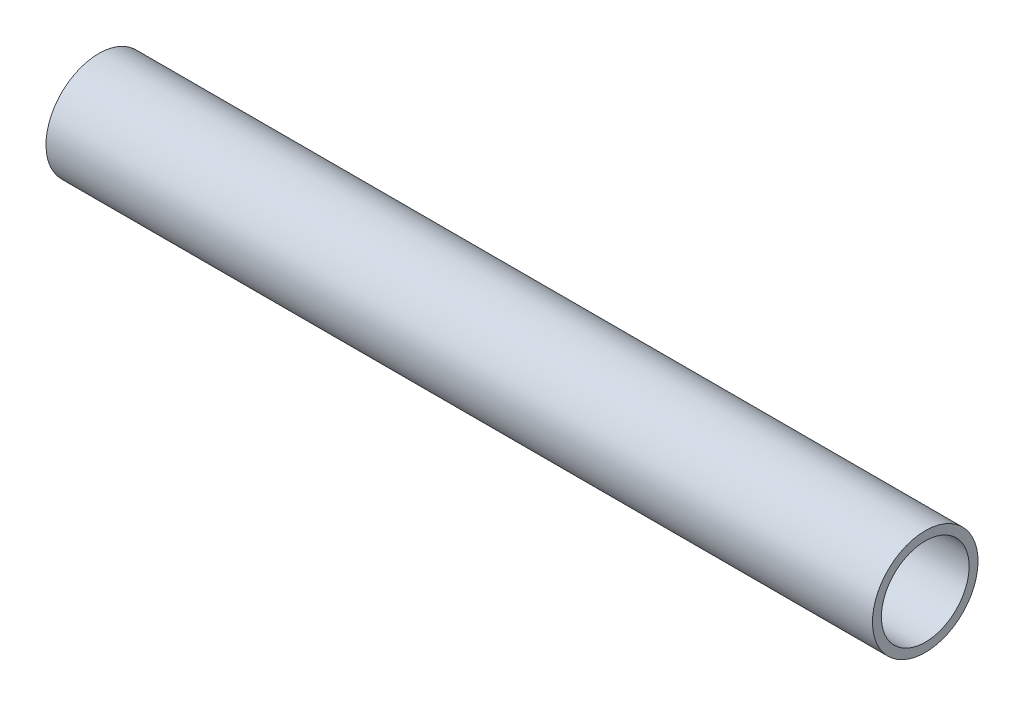
ISO-10303-21;
HEADER;
FILE_DESCRIPTION(('STEP AP214'),'2;1');
FILE_NAME('part.step','',(''),(''),'','','');
FILE_SCHEMA(('AUTOMOTIVE_DESIGN { 1 0 10303 214 1 1 1 1 }'));
ENDSEC;
DATA;
#1=APPLICATION_CONTEXT('core data for automotive mechanical design processes');
#2=APPLICATION_PROTOCOL_DEFINITION('international standard','automotive_design',2000,#1);
#3=PRODUCT_CONTEXT('',#1,'mechanical');
#4=PRODUCT('Part','Part','',(#3));
#5=PRODUCT_RELATED_PRODUCT_CATEGORY('part','',(#4));
#6=PRODUCT_DEFINITION_FORMATION('','',#4);
#7=PRODUCT_DEFINITION_CONTEXT('part definition',#1,'design');
#8=PRODUCT_DEFINITION('design','',#6,#7);
#9=PRODUCT_DEFINITION_SHAPE('','',#8);
#10=(LENGTH_UNIT() NAMED_UNIT(*) SI_UNIT(.MILLI.,.METRE.));
#11=(NAMED_UNIT(*) PLANE_ANGLE_UNIT() SI_UNIT($,.RADIAN.));
#12=(NAMED_UNIT(*) SI_UNIT($,.STERADIAN.) SOLID_ANGLE_UNIT());
#13=UNCERTAINTY_MEASURE_WITH_UNIT(LENGTH_MEASURE(1.E-05),#10,'distance_accuracy_value','');
#14=(GEOMETRIC_REPRESENTATION_CONTEXT(3) GLOBAL_UNCERTAINTY_ASSIGNED_CONTEXT((#13)) GLOBAL_UNIT_ASSIGNED_CONTEXT((#10,
#11,#12)) REPRESENTATION_CONTEXT('',''));
#15=CARTESIAN_POINT('',(0.,0.,0.));
#16=DIRECTION('',(0.,0.,1.));
#17=DIRECTION('',(1.,0.,0.));
#18=AXIS2_PLACEMENT_3D('',#15,#16,#17);
#19=CARTESIAN_POINT('',(165.1,-194.818,2112.518));
#20=DIRECTION('',(-1.,0.,0.));
#21=DIRECTION('',(0.,0.,1.));
#22=AXIS2_PLACEMENT_3D('',#19,#20,#21);
#23=CYLINDRICAL_SURFACE('',#22,17.526);
#24=CARTESIAN_POINT('',(165.1,-194.818,2112.518));
#25=DIRECTION('',(1.,0.,0.));
#26=DIRECTION('',(0.,1.,0.));
#27=AXIS2_PLACEMENT_3D('',#24,#25,#26);
#28=CIRCLE('',#27,17.526);
#29=CARTESIAN_POINT('',(165.1,-177.292,2112.518));
#30=VERTEX_POINT('',#29);
#31=EDGE_CURVE('E20',#30,#30,#28,.T.);
#32=ORIENTED_EDGE('',*,*,#31,.T.);
#33=EDGE_LOOP('',(#32));
#34=FACE_BOUND('',#33,.T.);
#35=CARTESIAN_POINT('',(-165.1,-194.818,2112.518));
#36=DIRECTION('',(1.,0.,0.));
#37=DIRECTION('',(0.,1.,0.));
#38=AXIS2_PLACEMENT_3D('',#35,#36,#37);
#39=CIRCLE('',#38,17.526);
#40=CARTESIAN_POINT('',(-165.1,-177.292,2112.518));
#41=VERTEX_POINT('',#40);
#42=EDGE_CURVE('E31',#41,#41,#39,.T.);
#43=ORIENTED_EDGE('',*,*,#42,.F.);
#44=EDGE_LOOP('',(#43));
#45=FACE_BOUND('',#44,.T.);
#46=ADVANCED_FACE('F12',(#34,#45),#23,.F.);
#47=CARTESIAN_POINT('',(165.1,-194.818,2112.518));
#48=DIRECTION('',(-1.,0.,0.));
#49=DIRECTION('',(0.,0.,1.));
#50=AXIS2_PLACEMENT_3D('',#47,#48,#49);
#51=CYLINDRICAL_SURFACE('',#50,21.082);
#52=CARTESIAN_POINT('',(165.1,-194.818,2112.518));
#53=DIRECTION('',(1.,0.,0.));
#54=DIRECTION('',(0.,1.,0.));
#55=AXIS2_PLACEMENT_3D('',#52,#53,#54);
#56=CIRCLE('',#55,21.082);
#57=CARTESIAN_POINT('',(165.1,-173.736,2112.518));
#58=VERTEX_POINT('',#57);
#59=EDGE_CURVE('E8',#58,#58,#56,.T.);
#60=ORIENTED_EDGE('',*,*,#59,.F.);
#61=EDGE_LOOP('',(#60));
#62=FACE_BOUND('',#61,.T.);
#63=CARTESIAN_POINT('',(-165.1,-194.818,2112.518));
#64=DIRECTION('',(1.,0.,0.));
#65=DIRECTION('',(0.,1.,0.));
#66=AXIS2_PLACEMENT_3D('',#63,#64,#65);
#67=CIRCLE('',#66,21.082);
#68=CARTESIAN_POINT('',(-165.1,-173.736,2112.518));
#69=VERTEX_POINT('',#68);
#70=EDGE_CURVE('E15',#69,#69,#67,.T.);
#71=ORIENTED_EDGE('',*,*,#70,.T.);
#72=EDGE_LOOP('',(#71));
#73=FACE_BOUND('',#72,.T.);
#74=ADVANCED_FACE('F40',(#62,#73),#51,.T.);
#75=CARTESIAN_POINT('',(165.1,266.7,2108.2));
#76=DIRECTION('',(1.,0.,0.));
#77=DIRECTION('',(0.,1.,0.));
#78=AXIS2_PLACEMENT_3D('',#75,#76,#77);
#79=PLANE('',#78);
#80=ORIENTED_EDGE('',*,*,#31,.F.);
#81=EDGE_LOOP('',(#80));
#82=FACE_BOUND('',#81,.T.);
#83=ORIENTED_EDGE('',*,*,#59,.T.);
#84=EDGE_LOOP('',(#83));
#85=FACE_BOUND('',#84,.T.);
#86=ADVANCED_FACE('F44',(#82,#85),#79,.T.);
#87=CARTESIAN_POINT('',(-165.1,266.7,2108.2));
#88=DIRECTION('',(1.,0.,0.));
#89=DIRECTION('',(0.,1.,0.));
#90=AXIS2_PLACEMENT_3D('',#87,#88,#89);
#91=PLANE('',#90);
#92=ORIENTED_EDGE('',*,*,#42,.T.);
#93=EDGE_LOOP('',(#92));
#94=FACE_BOUND('',#93,.T.);
#95=ORIENTED_EDGE('',*,*,#70,.F.);
#96=EDGE_LOOP('',(#95));
#97=FACE_BOUND('',#96,.T.);
#98=ADVANCED_FACE('F42',(#94,#97),#91,.F.);
#99=CLOSED_SHELL('',(#46,#74,#86,#98));
#100=MANIFOLD_SOLID_BREP('B1',#99);
#101=ADVANCED_BREP_SHAPE_REPRESENTATION('',(#18,#100),#14);
#102=SHAPE_DEFINITION_REPRESENTATION(#9,#101);
ENDSEC;
END-ISO-10303-21;
